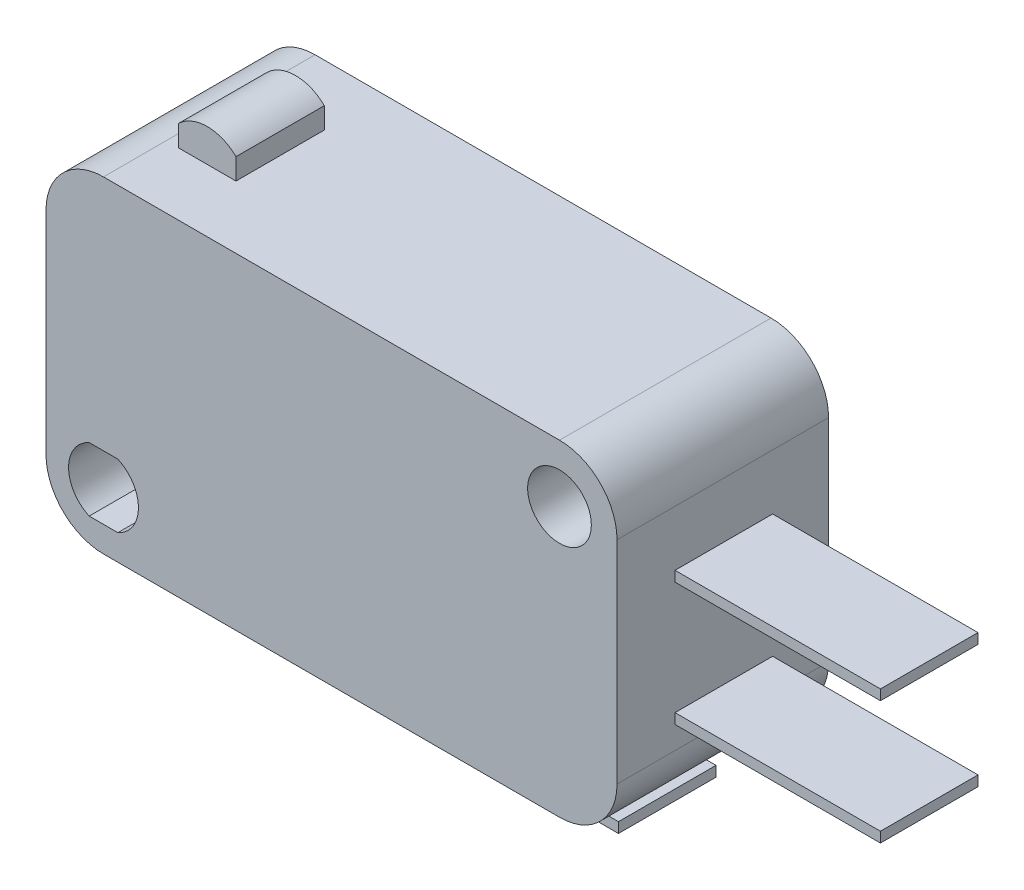
ISO-10303-21;
HEADER;
FILE_DESCRIPTION(('STEP AP214'),'2;1');
FILE_NAME('part.step','',(''),(''),'','','');
FILE_SCHEMA(('AUTOMOTIVE_DESIGN { 1 0 10303 214 1 1 1 1 }'));
ENDSEC;
DATA;
#1=APPLICATION_CONTEXT('core data for automotive mechanical design processes');
#2=APPLICATION_PROTOCOL_DEFINITION('international standard','automotive_design',2000,#1);
#3=PRODUCT_CONTEXT('',#1,'mechanical');
#4=PRODUCT('Part','Part','',(#3));
#5=PRODUCT_RELATED_PRODUCT_CATEGORY('part','',(#4));
#6=PRODUCT_DEFINITION_FORMATION('','',#4);
#7=PRODUCT_DEFINITION_CONTEXT('part definition',#1,'design');
#8=PRODUCT_DEFINITION('design','',#6,#7);
#9=PRODUCT_DEFINITION_SHAPE('','',#8);
#10=(LENGTH_UNIT() NAMED_UNIT(*) SI_UNIT(.MILLI.,.METRE.));
#11=(NAMED_UNIT(*) PLANE_ANGLE_UNIT() SI_UNIT($,.RADIAN.));
#12=(NAMED_UNIT(*) SI_UNIT($,.STERADIAN.) SOLID_ANGLE_UNIT());
#13=UNCERTAINTY_MEASURE_WITH_UNIT(LENGTH_MEASURE(1.E-05),#10,'distance_accuracy_value','');
#14=(GEOMETRIC_REPRESENTATION_CONTEXT(3) GLOBAL_UNCERTAINTY_ASSIGNED_CONTEXT((#13)) GLOBAL_UNIT_ASSIGNED_CONTEXT((#10,
#11,#12)) REPRESENTATION_CONTEXT('',''));
#15=CARTESIAN_POINT('',(0.,0.,0.));
#16=DIRECTION('',(0.,0.,1.));
#17=DIRECTION('',(1.,0.,0.));
#18=AXIS2_PLACEMENT_3D('',#15,#16,#17);
#19=CARTESIAN_POINT('',(-25.,2.8,5.15));
#20=DIRECTION('',(0.,-1.,0.));
#21=DIRECTION('',(0.,0.,-1.));
#22=AXIS2_PLACEMENT_3D('',#19,#20,#21);
#23=PLANE('',#22);
#24=DIRECTION('',(-1.,0.,0.));
#25=VECTOR('',#24,1.);
#26=CARTESIAN_POINT('',(-25.,2.8,-5.15));
#27=LINE('',#26,#25);
#28=CARTESIAN_POINT('',(0.,2.8,-5.15));
#29=VERTEX_POINT('',#28);
#30=CARTESIAN_POINT('',(-22.2,2.8,-5.15));
#31=VERTEX_POINT('',#30);
#32=EDGE_CURVE('E406',#29,#31,#27,.T.);
#33=ORIENTED_EDGE('',*,*,#32,.T.);
#34=DIRECTION('',(0.,0.,-1.));
#35=VECTOR('',#34,1.);
#36=CARTESIAN_POINT('',(-22.2,2.8,5.15));
#37=LINE('',#36,#35);
#38=CARTESIAN_POINT('',(-22.2,2.8,5.15));
#39=VERTEX_POINT('',#38);
#40=EDGE_CURVE('E436',#31,#39,#37,.F.);
#41=ORIENTED_EDGE('',*,*,#40,.T.);
#42=DIRECTION('',(-1.,0.,0.));
#43=VECTOR('',#42,1.);
#44=CARTESIAN_POINT('',(-25.,2.8,5.15));
#45=LINE('',#44,#43);
#46=CARTESIAN_POINT('',(0.,2.8,5.15));
#47=VERTEX_POINT('',#46);
#48=EDGE_CURVE('E417',#47,#39,#45,.T.);
#49=ORIENTED_EDGE('',*,*,#48,.F.);
#50=DIRECTION('',(0.,0.,-1.));
#51=VECTOR('',#50,1.);
#52=CARTESIAN_POINT('',(0.,2.8,5.15));
#53=LINE('',#52,#51);
#54=EDGE_CURVE('E433',#47,#29,#53,.T.);
#55=ORIENTED_EDGE('',*,*,#54,.T.);
#56=EDGE_LOOP('',(#33,#41,#49,#55));
#57=FACE_BOUND('',#56,.T.);
#58=DIRECTION('',(-1.,0.,0.));
#59=VECTOR('',#58,1.);
#60=CARTESIAN_POINT('',(-21.6,2.8,-2.2));
#61=LINE('',#60,#59);
#62=CARTESIAN_POINT('',(-18.8,2.8,-2.2));
#63=VERTEX_POINT('',#62);
#64=CARTESIAN_POINT('',(-21.6,2.8,-2.2));
#65=VERTEX_POINT('',#64);
#66=EDGE_CURVE('E244',#63,#65,#61,.T.);
#67=ORIENTED_EDGE('',*,*,#66,.F.);
#68=DIRECTION('',(0.,0.,1.));
#69=VECTOR('',#68,1.);
#70=CARTESIAN_POINT('',(-18.8,2.8,-2.2));
#71=LINE('',#70,#69);
#72=CARTESIAN_POINT('',(-18.8,2.8,2.1));
#73=VERTEX_POINT('',#72);
#74=EDGE_CURVE('E231',#63,#73,#71,.T.);
#75=ORIENTED_EDGE('',*,*,#74,.T.);
#76=DIRECTION('',(-1.,0.,0.));
#77=VECTOR('',#76,1.);
#78=CARTESIAN_POINT('',(-21.6,2.8,2.1));
#79=LINE('',#78,#77);
#80=CARTESIAN_POINT('',(-21.6,2.8,2.1));
#81=VERTEX_POINT('',#80);
#82=EDGE_CURVE('E218',#73,#81,#79,.T.);
#83=ORIENTED_EDGE('',*,*,#82,.T.);
#84=DIRECTION('',(0.,0.,1.));
#85=VECTOR('',#84,1.);
#86=CARTESIAN_POINT('',(-21.6,2.8,-2.2));
#87=LINE('',#86,#85);
#88=EDGE_CURVE('E249',#65,#81,#87,.T.);
#89=ORIENTED_EDGE('',*,*,#88,.F.);
#90=EDGE_LOOP('',(#67,#75,#83,#89));
#91=FACE_BOUND('',#90,.T.);
#92=ADVANCED_FACE('F16',(#57,#91),#23,.F.);
#93=CARTESIAN_POINT('',(-25.,-13.1,5.15));
#94=DIRECTION('',(0.,1.,0.));
#95=DIRECTION('',(-1.,0.,0.));
#96=AXIS2_PLACEMENT_3D('',#93,#94,#95);
#97=PLANE('',#96);
#98=DIRECTION('',(1.,0.,0.));
#99=VECTOR('',#98,1.);
#100=CARTESIAN_POINT('',(-25.,-13.1,5.15));
#101=LINE('',#100,#99);
#102=CARTESIAN_POINT('',(-22.2,-13.1,5.15));
#103=VERTEX_POINT('',#102);
#104=CARTESIAN_POINT('',(0.,-13.1,5.15));
#105=VERTEX_POINT('',#104);
#106=EDGE_CURVE('E412',#103,#105,#101,.T.);
#107=ORIENTED_EDGE('',*,*,#106,.F.);
#108=DIRECTION('',(0.,0.,-1.));
#109=VECTOR('',#108,1.);
#110=CARTESIAN_POINT('',(-22.2,-13.1,5.15));
#111=LINE('',#110,#109);
#112=CARTESIAN_POINT('',(-22.2,-13.1,-5.15));
#113=VERTEX_POINT('',#112);
#114=EDGE_CURVE('E448',#103,#113,#111,.T.);
#115=ORIENTED_EDGE('',*,*,#114,.T.);
#116=DIRECTION('',(1.,0.,0.));
#117=VECTOR('',#116,1.);
#118=CARTESIAN_POINT('',(-25.,-13.1,-5.15));
#119=LINE('',#118,#117);
#120=CARTESIAN_POINT('',(0.,-13.1,-5.15));
#121=VERTEX_POINT('',#120);
#122=EDGE_CURVE('E401',#113,#121,#119,.T.);
#123=ORIENTED_EDGE('',*,*,#122,.T.);
#124=DIRECTION('',(0.,0.,-1.));
#125=VECTOR('',#124,1.);
#126=CARTESIAN_POINT('',(0.,-13.1,5.15));
#127=LINE('',#126,#125);
#128=EDGE_CURVE('E446',#121,#105,#127,.F.);
#129=ORIENTED_EDGE('',*,*,#128,.T.);
#130=EDGE_LOOP('',(#107,#115,#123,#129));
#131=FACE_BOUND('',#130,.T.);
#132=DIRECTION('',(-1.,0.,0.));
#133=VECTOR('',#132,1.);
#134=CARTESIAN_POINT('',(-9.98,-13.1,1.5));
#135=LINE('',#134,#133);
#136=CARTESIAN_POINT('',(-9.48,-13.1,1.5));
#137=VERTEX_POINT('',#136);
#138=CARTESIAN_POINT('',(-9.98,-13.1,1.5));
#139=VERTEX_POINT('',#138);
#140=EDGE_CURVE('E302',#137,#139,#135,.T.);
#141=ORIENTED_EDGE('',*,*,#140,.F.);
#142=DIRECTION('',(0.,0.,-1.));
#143=VECTOR('',#142,1.);
#144=CARTESIAN_POINT('',(-9.48,-13.1,1.5));
#145=LINE('',#144,#143);
#146=CARTESIAN_POINT('',(-9.48,-13.1,-3.25));
#147=VERTEX_POINT('',#146);
#148=EDGE_CURVE('E315',#137,#147,#145,.T.);
#149=ORIENTED_EDGE('',*,*,#148,.T.);
#150=DIRECTION('',(-1.,0.,0.));
#151=VECTOR('',#150,1.);
#152=CARTESIAN_POINT('',(-9.98,-13.1,-3.25));
#153=LINE('',#152,#151);
#154=CARTESIAN_POINT('',(-9.98,-13.1,-3.25));
#155=VERTEX_POINT('',#154);
#156=EDGE_CURVE('E289',#147,#155,#153,.T.);
#157=ORIENTED_EDGE('',*,*,#156,.T.);
#158=DIRECTION('',(0.,0.,-1.));
#159=VECTOR('',#158,1.);
#160=CARTESIAN_POINT('',(-9.98,-13.1,1.5));
#161=LINE('',#160,#159);
#162=EDGE_CURVE('E330',#139,#155,#161,.T.);
#163=ORIENTED_EDGE('',*,*,#162,.F.);
#164=EDGE_LOOP('',(#141,#149,#157,#163));
#165=FACE_BOUND('',#164,.T.);
#166=ADVANCED_FACE('F454',(#131,#165),#97,.F.);
#167=CARTESIAN_POINT('',(2.8,2.8,5.15));
#168=DIRECTION('',(-1.,0.,0.));
#169=DIRECTION('',(0.,-1.,0.));
#170=AXIS2_PLACEMENT_3D('',#167,#168,#169);
#171=PLANE('',#170);
#172=DIRECTION('',(0.,-1.,0.));
#173=VECTOR('',#172,1.);
#174=CARTESIAN_POINT('',(2.8,-2.7,2.325));
#175=LINE('',#174,#173);
#176=CARTESIAN_POINT('',(2.8,-2.7,2.325));
#177=VERTEX_POINT('',#176);
#178=CARTESIAN_POINT('',(2.8,-3.2,2.325));
#179=VERTEX_POINT('',#178);
#180=EDGE_CURVE('E365',#177,#179,#175,.T.);
#181=ORIENTED_EDGE('',*,*,#180,.F.);
#182=DIRECTION('',(0.,0.,1.));
#183=VECTOR('',#182,1.);
#184=CARTESIAN_POINT('',(2.8,-2.7,2.325));
#185=LINE('',#184,#183);
#186=CARTESIAN_POINT('',(2.8,-2.7,-2.425));
#187=VERTEX_POINT('',#186);
#188=EDGE_CURVE('E374',#187,#177,#185,.T.);
#189=ORIENTED_EDGE('',*,*,#188,.F.);
#190=DIRECTION('',(0.,1.,0.));
#191=VECTOR('',#190,1.);
#192=CARTESIAN_POINT('',(2.8,-2.7,-2.425));
#193=LINE('',#192,#191);
#194=CARTESIAN_POINT('',(2.8,-3.2,-2.425));
#195=VERTEX_POINT('',#194);
#196=EDGE_CURVE('E371',#195,#187,#193,.T.);
#197=ORIENTED_EDGE('',*,*,#196,.F.);
#198=DIRECTION('',(0.,0.,-1.));
#199=VECTOR('',#198,1.);
#200=CARTESIAN_POINT('',(2.8,-3.2,2.325));
#201=LINE('',#200,#199);
#202=EDGE_CURVE('E368',#179,#195,#201,.T.);
#203=ORIENTED_EDGE('',*,*,#202,.F.);
#204=EDGE_LOOP('',(#181,#189,#197,#203));
#205=FACE_BOUND('',#204,.T.);
#206=DIRECTION('',(0.,1.,0.));
#207=VECTOR('',#206,1.);
#208=CARTESIAN_POINT('',(2.8,2.8,5.15));
#209=LINE('',#208,#207);
#210=CARTESIAN_POINT('',(2.8,-10.3,5.15));
#211=VERTEX_POINT('',#210);
#212=CARTESIAN_POINT('',(2.8,0.,5.15));
#213=VERTEX_POINT('',#212);
#214=EDGE_CURVE('E415',#211,#213,#209,.T.);
#215=ORIENTED_EDGE('',*,*,#214,.F.);
#216=DIRECTION('',(0.,0.,-1.));
#217=VECTOR('',#216,1.);
#218=CARTESIAN_POINT('',(2.8,-10.3,5.15));
#219=LINE('',#218,#217);
#220=CARTESIAN_POINT('',(2.8,-10.3,-5.15));
#221=VERTEX_POINT('',#220);
#222=EDGE_CURVE('E11',#211,#221,#219,.T.);
#223=ORIENTED_EDGE('',*,*,#222,.T.);
#224=DIRECTION('',(0.,1.,0.));
#225=VECTOR('',#224,1.);
#226=CARTESIAN_POINT('',(2.8,2.8,-5.15));
#227=LINE('',#226,#225);
#228=CARTESIAN_POINT('',(2.8,0.,-5.15));
#229=VERTEX_POINT('',#228);
#230=EDGE_CURVE('E404',#221,#229,#227,.T.);
#231=ORIENTED_EDGE('',*,*,#230,.T.);
#232=DIRECTION('',(0.,0.,-1.));
#233=VECTOR('',#232,1.);
#234=CARTESIAN_POINT('',(2.8,0.,5.15));
#235=LINE('',#234,#233);
#236=EDGE_CURVE('E24',#229,#213,#235,.F.);
#237=ORIENTED_EDGE('',*,*,#236,.T.);
#238=EDGE_LOOP('',(#215,#223,#231,#237));
#239=FACE_BOUND('',#238,.T.);
#240=DIRECTION('',(0.,-1.,0.));
#241=VECTOR('',#240,1.);
#242=CARTESIAN_POINT('',(2.8,-8.7,2.325));
#243=LINE('',#242,#241);
#244=CARTESIAN_POINT('',(2.8,-8.7,2.325));
#245=VERTEX_POINT('',#244);
#246=CARTESIAN_POINT('',(2.8,-9.2,2.325));
#247=VERTEX_POINT('',#246);
#248=EDGE_CURVE('E332',#245,#247,#243,.T.);
#249=ORIENTED_EDGE('',*,*,#248,.F.);
#250=DIRECTION('',(0.,0.,1.));
#251=VECTOR('',#250,1.);
#252=CARTESIAN_POINT('',(2.8,-8.7,2.325));
#253=LINE('',#252,#251);
#254=CARTESIAN_POINT('',(2.8,-8.7,-2.425));
#255=VERTEX_POINT('',#254);
#256=EDGE_CURVE('E341',#255,#245,#253,.T.);
#257=ORIENTED_EDGE('',*,*,#256,.F.);
#258=DIRECTION('',(0.,1.,0.));
#259=VECTOR('',#258,1.);
#260=CARTESIAN_POINT('',(2.8,-8.7,-2.425));
#261=LINE('',#260,#259);
#262=CARTESIAN_POINT('',(2.8,-9.2,-2.425));
#263=VERTEX_POINT('',#262);
#264=EDGE_CURVE('E338',#263,#255,#261,.T.);
#265=ORIENTED_EDGE('',*,*,#264,.F.);
#266=DIRECTION('',(0.,0.,-1.));
#267=VECTOR('',#266,1.);
#268=CARTESIAN_POINT('',(2.8,-9.2,2.325));
#269=LINE('',#268,#267);
#270=EDGE_CURVE('E335',#247,#263,#269,.T.);
#271=ORIENTED_EDGE('',*,*,#270,.F.);
#272=EDGE_LOOP('',(#249,#257,#265,#271));
#273=FACE_BOUND('',#272,.T.);
#274=ADVANCED_FACE('F467',(#205,#239,#273),#171,.F.);
#275=CARTESIAN_POINT('',(-25.,2.8,5.15));
#276=DIRECTION('',(1.,0.,0.));
#277=DIRECTION('',(0.,1.,0.));
#278=AXIS2_PLACEMENT_3D('',#275,#276,#277);
#279=PLANE('',#278);
#280=DIRECTION('',(0.,-1.,0.));
#281=VECTOR('',#280,1.);
#282=CARTESIAN_POINT('',(-25.,2.8,5.15));
#283=LINE('',#282,#281);
#284=CARTESIAN_POINT('',(-25.,0.,5.15));
#285=VERTEX_POINT('',#284);
#286=CARTESIAN_POINT('',(-25.,-10.3,5.15));
#287=VERTEX_POINT('',#286);
#288=EDGE_CURVE('E409',#285,#287,#283,.T.);
#289=ORIENTED_EDGE('',*,*,#288,.F.);
#290=DIRECTION('',(0.,0.,-1.));
#291=VECTOR('',#290,1.);
#292=CARTESIAN_POINT('',(-25.,0.,5.15));
#293=LINE('',#292,#291);
#294=CARTESIAN_POINT('',(-25.,0.,-5.15));
#295=VERTEX_POINT('',#294);
#296=EDGE_CURVE('E422',#285,#295,#293,.T.);
#297=ORIENTED_EDGE('',*,*,#296,.T.);
#298=DIRECTION('',(0.,-1.,0.));
#299=VECTOR('',#298,1.);
#300=CARTESIAN_POINT('',(-25.,2.8,-5.15));
#301=LINE('',#300,#299);
#302=CARTESIAN_POINT('',(-25.,-10.3,-5.15));
#303=VERTEX_POINT('',#302);
#304=EDGE_CURVE('E398',#295,#303,#301,.T.);
#305=ORIENTED_EDGE('',*,*,#304,.T.);
#306=DIRECTION('',(0.,0.,-1.));
#307=VECTOR('',#306,1.);
#308=CARTESIAN_POINT('',(-25.,-10.3,5.15));
#309=LINE('',#308,#307);
#310=EDGE_CURVE('E420',#303,#287,#309,.F.);
#311=ORIENTED_EDGE('',*,*,#310,.T.);
#312=EDGE_LOOP('',(#289,#297,#305,#311));
#313=FACE_BOUND('',#312,.T.);
#314=ADVANCED_FACE('F18',(#313),#279,.F.);
#315=CARTESIAN_POINT('',(-25.,2.8,5.15));
#316=DIRECTION('',(0.,0.,1.));
#317=DIRECTION('',(1.,0.,0.));
#318=AXIS2_PLACEMENT_3D('',#315,#316,#317);
#319=PLANE('',#318);
#320=CARTESIAN_POINT('',(-22.2,-10.3,5.15));
#321=DIRECTION('',(0.,0.,1.));
#322=DIRECTION('',(1.,0.,0.));
#323=AXIS2_PLACEMENT_3D('',#320,#321,#322);
#324=CIRCLE('',#323,1.7);
#325=CARTESIAN_POINT('',(-22.8982120021885,-8.75,5.15));
#326=VERTEX_POINT('',#325);
#327=CARTESIAN_POINT('',(-22.8982120021884,-11.85,5.15));
#328=VERTEX_POINT('',#327);
#329=EDGE_CURVE('E230',#326,#328,#324,.T.);
#330=ORIENTED_EDGE('',*,*,#329,.F.);
#331=DIRECTION('',(-1.,0.,0.));
#332=VECTOR('',#331,1.);
#333=CARTESIAN_POINT('',(-22.8982120021885,-8.75,5.15));
#334=LINE('',#333,#332);
#335=CARTESIAN_POINT('',(-21.5017879978115,-8.75,5.15));
#336=VERTEX_POINT('',#335);
#337=EDGE_CURVE('E259',#336,#326,#334,.T.);
#338=ORIENTED_EDGE('',*,*,#337,.F.);
#339=CARTESIAN_POINT('',(-22.2,-10.3,5.15));
#340=DIRECTION('',(0.,0.,1.));
#341=DIRECTION('',(1.,0.,0.));
#342=AXIS2_PLACEMENT_3D('',#339,#340,#341);
#343=CIRCLE('',#342,1.7);
#344=CARTESIAN_POINT('',(-21.5017879978116,-11.85,5.15));
#345=VERTEX_POINT('',#344);
#346=EDGE_CURVE('E256',#345,#336,#343,.T.);
#347=ORIENTED_EDGE('',*,*,#346,.F.);
#348=DIRECTION('',(1.,0.,0.));
#349=VECTOR('',#348,1.);
#350=CARTESIAN_POINT('',(-22.8982120021884,-11.85,5.15));
#351=LINE('',#350,#349);
#352=EDGE_CURVE('E253',#328,#345,#351,.T.);
#353=ORIENTED_EDGE('',*,*,#352,.F.);
#354=EDGE_LOOP('',(#330,#338,#347,#353));
#355=FACE_BOUND('',#354,.T.);
#356=CARTESIAN_POINT('',(0.,0.,5.15));
#357=DIRECTION('',(0.,0.,1.));
#358=DIRECTION('',(1.,0.,0.));
#359=AXIS2_PLACEMENT_3D('',#356,#357,#358);
#360=CIRCLE('',#359,1.55);
#361=CARTESIAN_POINT('',(1.55,0.,5.15));
#362=VERTEX_POINT('',#361);
#363=EDGE_CURVE('E277',#362,#362,#360,.T.);
#364=ORIENTED_EDGE('',*,*,#363,.F.);
#365=EDGE_LOOP('',(#364));
#366=FACE_BOUND('',#365,.T.);
#367=ORIENTED_EDGE('',*,*,#48,.T.);
#368=CARTESIAN_POINT('',(-22.2,0.,5.15));
#369=DIRECTION('',(0.,0.,1.));
#370=DIRECTION('',(1.,0.,0.));
#371=AXIS2_PLACEMENT_3D('',#368,#369,#370);
#372=CIRCLE('',#371,2.8);
#373=EDGE_CURVE('E444',#39,#285,#372,.T.);
#374=ORIENTED_EDGE('',*,*,#373,.T.);
#375=ORIENTED_EDGE('',*,*,#288,.T.);
#376=CARTESIAN_POINT('',(-22.2,-10.3,5.15));
#377=DIRECTION('',(0.,0.,1.));
#378=DIRECTION('',(1.,0.,0.));
#379=AXIS2_PLACEMENT_3D('',#376,#377,#378);
#380=CIRCLE('',#379,2.8);
#381=EDGE_CURVE('E442',#287,#103,#380,.T.);
#382=ORIENTED_EDGE('',*,*,#381,.T.);
#383=ORIENTED_EDGE('',*,*,#106,.T.);
#384=CARTESIAN_POINT('',(0.,-10.3,5.15));
#385=DIRECTION('',(0.,0.,1.));
#386=DIRECTION('',(1.,0.,0.));
#387=AXIS2_PLACEMENT_3D('',#384,#385,#386);
#388=CIRCLE('',#387,2.8);
#389=EDGE_CURVE('E440',#105,#211,#388,.T.);
#390=ORIENTED_EDGE('',*,*,#389,.T.);
#391=ORIENTED_EDGE('',*,*,#214,.T.);
#392=CARTESIAN_POINT('',(0.,0.,5.15));
#393=DIRECTION('',(0.,0.,1.));
#394=DIRECTION('',(1.,0.,0.));
#395=AXIS2_PLACEMENT_3D('',#392,#393,#394);
#396=CIRCLE('',#395,2.8);
#397=EDGE_CURVE('E438',#213,#47,#396,.T.);
#398=ORIENTED_EDGE('',*,*,#397,.T.);
#399=EDGE_LOOP('',(#367,#374,#375,#382,#383,#390,#391,#398));
#400=FACE_BOUND('',#399,.T.);
#401=ADVANCED_FACE('F471',(#355,#366,#400),#319,.T.);
#402=CARTESIAN_POINT('',(-25.,2.8,-5.15));
#403=DIRECTION('',(0.,0.,1.));
#404=DIRECTION('',(1.,0.,0.));
#405=AXIS2_PLACEMENT_3D('',#402,#403,#404);
#406=PLANE('',#405);
#407=DIRECTION('',(-1.,0.,0.));
#408=VECTOR('',#407,1.);
#409=CARTESIAN_POINT('',(-22.8982120021885,-8.75,-5.15));
#410=LINE('',#409,#408);
#411=CARTESIAN_POINT('',(-21.5017879978115,-8.75,-5.15));
#412=VERTEX_POINT('',#411);
#413=CARTESIAN_POINT('',(-22.8982120021885,-8.75,-5.15));
#414=VERTEX_POINT('',#413);
#415=EDGE_CURVE('E271',#412,#414,#410,.T.);
#416=ORIENTED_EDGE('',*,*,#415,.T.);
#417=CARTESIAN_POINT('',(-22.2,-10.3,-5.15));
#418=DIRECTION('',(0.,0.,1.));
#419=DIRECTION('',(1.,0.,0.));
#420=AXIS2_PLACEMENT_3D('',#417,#418,#419);
#421=CIRCLE('',#420,1.7);
#422=CARTESIAN_POINT('',(-22.8982120021884,-11.85,-5.15));
#423=VERTEX_POINT('',#422);
#424=EDGE_CURVE('E262',#414,#423,#421,.T.);
#425=ORIENTED_EDGE('',*,*,#424,.T.);
#426=DIRECTION('',(1.,0.,0.));
#427=VECTOR('',#426,1.);
#428=CARTESIAN_POINT('',(-22.8982120021884,-11.85,-5.15));
#429=LINE('',#428,#427);
#430=CARTESIAN_POINT('',(-21.5017879978116,-11.85,-5.15));
#431=VERTEX_POINT('',#430);
#432=EDGE_CURVE('E265',#423,#431,#429,.T.);
#433=ORIENTED_EDGE('',*,*,#432,.T.);
#434=CARTESIAN_POINT('',(-22.2,-10.3,-5.15));
#435=DIRECTION('',(0.,0.,1.));
#436=DIRECTION('',(1.,0.,0.));
#437=AXIS2_PLACEMENT_3D('',#434,#435,#436);
#438=CIRCLE('',#437,1.7);
#439=EDGE_CURVE('E268',#431,#412,#438,.T.);
#440=ORIENTED_EDGE('',*,*,#439,.T.);
#441=EDGE_LOOP('',(#416,#425,#433,#440));
#442=FACE_BOUND('',#441,.T.);
#443=CARTESIAN_POINT('',(0.,0.,-5.15));
#444=DIRECTION('',(0.,0.,1.));
#445=DIRECTION('',(1.,0.,0.));
#446=AXIS2_PLACEMENT_3D('',#443,#444,#445);
#447=CIRCLE('',#446,1.55);
#448=CARTESIAN_POINT('',(1.55,0.,-5.15));
#449=VERTEX_POINT('',#448);
#450=EDGE_CURVE('E286',#449,#449,#447,.T.);
#451=ORIENTED_EDGE('',*,*,#450,.T.);
#452=EDGE_LOOP('',(#451));
#453=FACE_BOUND('',#452,.T.);
#454=ORIENTED_EDGE('',*,*,#304,.F.);
#455=CARTESIAN_POINT('',(-22.2,0.,-5.15));
#456=DIRECTION('',(0.,0.,1.));
#457=DIRECTION('',(1.,0.,0.));
#458=AXIS2_PLACEMENT_3D('',#455,#456,#457);
#459=CIRCLE('',#458,2.8);
#460=EDGE_CURVE('E431',#295,#31,#459,.F.);
#461=ORIENTED_EDGE('',*,*,#460,.T.);
#462=ORIENTED_EDGE('',*,*,#32,.F.);
#463=CARTESIAN_POINT('',(0.,0.,-5.15));
#464=DIRECTION('',(0.,0.,1.));
#465=DIRECTION('',(1.,0.,0.));
#466=AXIS2_PLACEMENT_3D('',#463,#464,#465);
#467=CIRCLE('',#466,2.8);
#468=EDGE_CURVE('E425',#29,#229,#467,.F.);
#469=ORIENTED_EDGE('',*,*,#468,.T.);
#470=ORIENTED_EDGE('',*,*,#230,.F.);
#471=CARTESIAN_POINT('',(0.,-10.3,-5.15));
#472=DIRECTION('',(0.,0.,1.));
#473=DIRECTION('',(1.,0.,0.));
#474=AXIS2_PLACEMENT_3D('',#471,#472,#473);
#475=CIRCLE('',#474,2.8);
#476=EDGE_CURVE('E427',#221,#121,#475,.F.);
#477=ORIENTED_EDGE('',*,*,#476,.T.);
#478=ORIENTED_EDGE('',*,*,#122,.F.);
#479=CARTESIAN_POINT('',(-22.2,-10.3,-5.15));
#480=DIRECTION('',(0.,0.,1.));
#481=DIRECTION('',(1.,0.,0.));
#482=AXIS2_PLACEMENT_3D('',#479,#480,#481);
#483=CIRCLE('',#482,2.8);
#484=EDGE_CURVE('E429',#113,#303,#483,.F.);
#485=ORIENTED_EDGE('',*,*,#484,.T.);
#486=EDGE_LOOP('',(#454,#461,#462,#469,#470,#477,#478,#485));
#487=FACE_BOUND('',#486,.T.);
#488=ADVANCED_FACE('F461',(#442,#453,#487),#406,.F.);
#489=CARTESIAN_POINT('',(12.8,-2.7,2.325));
#490=DIRECTION('',(0.,0.,-1.));
#491=DIRECTION('',(0.,1.,0.));
#492=AXIS2_PLACEMENT_3D('',#489,#490,#491);
#493=PLANE('',#492);
#494=ORIENTED_EDGE('',*,*,#180,.T.);
#495=DIRECTION('',(-1.,0.,0.));
#496=VECTOR('',#495,1.);
#497=CARTESIAN_POINT('',(12.8,-3.2,2.325));
#498=LINE('',#497,#496);
#499=CARTESIAN_POINT('',(12.8,-3.2,2.325));
#500=VERTEX_POINT('',#499);
#501=EDGE_CURVE('E395',#500,#179,#498,.T.);
#502=ORIENTED_EDGE('',*,*,#501,.F.);
#503=DIRECTION('',(0.,-1.,0.));
#504=VECTOR('',#503,1.);
#505=CARTESIAN_POINT('',(12.8,-2.7,2.325));
#506=LINE('',#505,#504);
#507=CARTESIAN_POINT('',(12.8,-2.7,2.325));
#508=VERTEX_POINT('',#507);
#509=EDGE_CURVE('E377',#508,#500,#506,.T.);
#510=ORIENTED_EDGE('',*,*,#509,.F.);
#511=DIRECTION('',(-1.,0.,0.));
#512=VECTOR('',#511,1.);
#513=CARTESIAN_POINT('',(12.8,-2.7,2.325));
#514=LINE('',#513,#512);
#515=EDGE_CURVE('E386',#508,#177,#514,.T.);
#516=ORIENTED_EDGE('',*,*,#515,.T.);
#517=EDGE_LOOP('',(#494,#502,#510,#516));
#518=FACE_BOUND('',#517,.T.);
#519=ADVANCED_FACE('F519',(#518),#493,.F.);
#520=CARTESIAN_POINT('',(12.8,-3.2,2.325));
#521=DIRECTION('',(0.,1.,0.));
#522=DIRECTION('',(-1.,0.,0.));
#523=AXIS2_PLACEMENT_3D('',#520,#521,#522);
#524=PLANE('',#523);
#525=ORIENTED_EDGE('',*,*,#202,.T.);
#526=DIRECTION('',(-1.,0.,0.));
#527=VECTOR('',#526,1.);
#528=CARTESIAN_POINT('',(12.8,-3.2,-2.425));
#529=LINE('',#528,#527);
#530=CARTESIAN_POINT('',(12.8,-3.2,-2.425));
#531=VERTEX_POINT('',#530);
#532=EDGE_CURVE('E392',#531,#195,#529,.T.);
#533=ORIENTED_EDGE('',*,*,#532,.F.);
#534=DIRECTION('',(0.,0.,-1.));
#535=VECTOR('',#534,1.);
#536=CARTESIAN_POINT('',(12.8,-3.2,2.325));
#537=LINE('',#536,#535);
#538=EDGE_CURVE('E380',#500,#531,#537,.T.);
#539=ORIENTED_EDGE('',*,*,#538,.F.);
#540=ORIENTED_EDGE('',*,*,#501,.T.);
#541=EDGE_LOOP('',(#525,#533,#539,#540));
#542=FACE_BOUND('',#541,.T.);
#543=ADVANCED_FACE('F527',(#542),#524,.F.);
#544=CARTESIAN_POINT('',(12.8,-2.7,-2.425));
#545=DIRECTION('',(0.,0.,1.));
#546=DIRECTION('',(0.,-1.,0.));
#547=AXIS2_PLACEMENT_3D('',#544,#545,#546);
#548=PLANE('',#547);
#549=ORIENTED_EDGE('',*,*,#196,.T.);
#550=DIRECTION('',(-1.,0.,0.));
#551=VECTOR('',#550,1.);
#552=CARTESIAN_POINT('',(12.8,-2.7,-2.425));
#553=LINE('',#552,#551);
#554=CARTESIAN_POINT('',(12.8,-2.7,-2.425));
#555=VERTEX_POINT('',#554);
#556=EDGE_CURVE('E389',#555,#187,#553,.T.);
#557=ORIENTED_EDGE('',*,*,#556,.F.);
#558=DIRECTION('',(0.,1.,0.));
#559=VECTOR('',#558,1.);
#560=CARTESIAN_POINT('',(12.8,-2.7,-2.425));
#561=LINE('',#560,#559);
#562=EDGE_CURVE('E382',#531,#555,#561,.T.);
#563=ORIENTED_EDGE('',*,*,#562,.F.);
#564=ORIENTED_EDGE('',*,*,#532,.T.);
#565=EDGE_LOOP('',(#549,#557,#563,#564));
#566=FACE_BOUND('',#565,.T.);
#567=ADVANCED_FACE('F525',(#566),#548,.F.);
#568=CARTESIAN_POINT('',(12.8,-2.7,2.325));
#569=DIRECTION('',(0.,-1.,0.));
#570=DIRECTION('',(1.,0.,0.));
#571=AXIS2_PLACEMENT_3D('',#568,#569,#570);
#572=PLANE('',#571);
#573=ORIENTED_EDGE('',*,*,#188,.T.);
#574=ORIENTED_EDGE('',*,*,#515,.F.);
#575=DIRECTION('',(0.,0.,1.));
#576=VECTOR('',#575,1.);
#577=CARTESIAN_POINT('',(12.8,-2.7,2.325));
#578=LINE('',#577,#576);
#579=EDGE_CURVE('E384',#555,#508,#578,.T.);
#580=ORIENTED_EDGE('',*,*,#579,.F.);
#581=ORIENTED_EDGE('',*,*,#556,.T.);
#582=EDGE_LOOP('',(#573,#574,#580,#581));
#583=FACE_BOUND('',#582,.T.);
#584=ADVANCED_FACE('F515',(#583),#572,.F.);
#585=CARTESIAN_POINT('',(12.8,-3.2,2.325));
#586=DIRECTION('',(1.,0.,0.));
#587=DIRECTION('',(0.,0.,-1.));
#588=AXIS2_PLACEMENT_3D('',#585,#586,#587);
#589=PLANE('',#588);
#590=ORIENTED_EDGE('',*,*,#509,.T.);
#591=ORIENTED_EDGE('',*,*,#538,.T.);
#592=ORIENTED_EDGE('',*,*,#562,.T.);
#593=ORIENTED_EDGE('',*,*,#579,.T.);
#594=EDGE_LOOP('',(#590,#591,#592,#593));
#595=FACE_BOUND('',#594,.T.);
#596=ADVANCED_FACE('F521',(#595),#589,.T.);
#597=CARTESIAN_POINT('',(12.8,-8.7,2.325));
#598=DIRECTION('',(0.,0.,-1.));
#599=DIRECTION('',(0.,1.,0.));
#600=AXIS2_PLACEMENT_3D('',#597,#598,#599);
#601=PLANE('',#600);
#602=ORIENTED_EDGE('',*,*,#248,.T.);
#603=DIRECTION('',(-1.,0.,0.));
#604=VECTOR('',#603,1.);
#605=CARTESIAN_POINT('',(12.8,-9.2,2.325));
#606=LINE('',#605,#604);
#607=CARTESIAN_POINT('',(12.8,-9.2,2.325));
#608=VERTEX_POINT('',#607);
#609=EDGE_CURVE('E362',#608,#247,#606,.T.);
#610=ORIENTED_EDGE('',*,*,#609,.F.);
#611=DIRECTION('',(0.,-1.,0.));
#612=VECTOR('',#611,1.);
#613=CARTESIAN_POINT('',(12.8,-8.7,2.325));
#614=LINE('',#613,#612);
#615=CARTESIAN_POINT('',(12.8,-8.7,2.325));
#616=VERTEX_POINT('',#615);
#617=EDGE_CURVE('E344',#616,#608,#614,.T.);
#618=ORIENTED_EDGE('',*,*,#617,.F.);
#619=DIRECTION('',(-1.,0.,0.));
#620=VECTOR('',#619,1.);
#621=CARTESIAN_POINT('',(12.8,-8.7,2.325));
#622=LINE('',#621,#620);
#623=EDGE_CURVE('E353',#616,#245,#622,.T.);
#624=ORIENTED_EDGE('',*,*,#623,.T.);
#625=EDGE_LOOP('',(#602,#610,#618,#624));
#626=FACE_BOUND('',#625,.T.);
#627=ADVANCED_FACE('F605',(#626),#601,.F.);
#628=CARTESIAN_POINT('',(12.8,-9.2,2.325));
#629=DIRECTION('',(0.,1.,0.));
#630=DIRECTION('',(-1.,0.,0.));
#631=AXIS2_PLACEMENT_3D('',#628,#629,#630);
#632=PLANE('',#631);
#633=ORIENTED_EDGE('',*,*,#270,.T.);
#634=DIRECTION('',(-1.,0.,0.));
#635=VECTOR('',#634,1.);
#636=CARTESIAN_POINT('',(12.8,-9.2,-2.425));
#637=LINE('',#636,#635);
#638=CARTESIAN_POINT('',(12.8,-9.2,-2.425));
#639=VERTEX_POINT('',#638);
#640=EDGE_CURVE('E359',#639,#263,#637,.T.);
#641=ORIENTED_EDGE('',*,*,#640,.F.);
#642=DIRECTION('',(0.,0.,-1.));
#643=VECTOR('',#642,1.);
#644=CARTESIAN_POINT('',(12.8,-9.2,2.325));
#645=LINE('',#644,#643);
#646=EDGE_CURVE('E347',#608,#639,#645,.T.);
#647=ORIENTED_EDGE('',*,*,#646,.F.);
#648=ORIENTED_EDGE('',*,*,#609,.T.);
#649=EDGE_LOOP('',(#633,#641,#647,#648));
#650=FACE_BOUND('',#649,.T.);
#651=ADVANCED_FACE('F601',(#650),#632,.F.);
#652=CARTESIAN_POINT('',(12.8,-8.7,-2.425));
#653=DIRECTION('',(0.,0.,1.));
#654=DIRECTION('',(1.,0.,0.));
#655=AXIS2_PLACEMENT_3D('',#652,#653,#654);
#656=PLANE('',#655);
#657=ORIENTED_EDGE('',*,*,#264,.T.);
#658=DIRECTION('',(-1.,0.,0.));
#659=VECTOR('',#658,1.);
#660=CARTESIAN_POINT('',(12.8,-8.7,-2.425));
#661=LINE('',#660,#659);
#662=CARTESIAN_POINT('',(12.8,-8.7,-2.425));
#663=VERTEX_POINT('',#662);
#664=EDGE_CURVE('E356',#663,#255,#661,.T.);
#665=ORIENTED_EDGE('',*,*,#664,.F.);
#666=DIRECTION('',(0.,1.,0.));
#667=VECTOR('',#666,1.);
#668=CARTESIAN_POINT('',(12.8,-8.7,-2.425));
#669=LINE('',#668,#667);
#670=EDGE_CURVE('E349',#639,#663,#669,.T.);
#671=ORIENTED_EDGE('',*,*,#670,.F.);
#672=ORIENTED_EDGE('',*,*,#640,.T.);
#673=EDGE_LOOP('',(#657,#665,#671,#672));
#674=FACE_BOUND('',#673,.T.);
#675=ADVANCED_FACE('F597',(#674),#656,.F.);
#676=CARTESIAN_POINT('',(12.8,-8.7,2.325));
#677=DIRECTION('',(0.,-1.,0.));
#678=DIRECTION('',(1.,0.,0.));
#679=AXIS2_PLACEMENT_3D('',#676,#677,#678);
#680=PLANE('',#679);
#681=ORIENTED_EDGE('',*,*,#256,.T.);
#682=ORIENTED_EDGE('',*,*,#623,.F.);
#683=DIRECTION('',(0.,0.,1.));
#684=VECTOR('',#683,1.);
#685=CARTESIAN_POINT('',(12.8,-8.7,2.325));
#686=LINE('',#685,#684);
#687=EDGE_CURVE('E351',#663,#616,#686,.T.);
#688=ORIENTED_EDGE('',*,*,#687,.F.);
#689=ORIENTED_EDGE('',*,*,#664,.T.);
#690=EDGE_LOOP('',(#681,#682,#688,#689));
#691=FACE_BOUND('',#690,.T.);
#692=ADVANCED_FACE('F593',(#691),#680,.F.);
#693=CARTESIAN_POINT('',(12.8,-9.2,2.325));
#694=DIRECTION('',(1.,0.,0.));
#695=DIRECTION('',(0.,0.,-1.));
#696=AXIS2_PLACEMENT_3D('',#693,#694,#695);
#697=PLANE('',#696);
#698=ORIENTED_EDGE('',*,*,#617,.T.);
#699=ORIENTED_EDGE('',*,*,#646,.T.);
#700=ORIENTED_EDGE('',*,*,#670,.T.);
#701=ORIENTED_EDGE('',*,*,#687,.T.);
#702=EDGE_LOOP('',(#698,#699,#700,#701));
#703=FACE_BOUND('',#702,.T.);
#704=ADVANCED_FACE('F589',(#703),#697,.T.);
#705=CARTESIAN_POINT('',(-9.98,-16.,1.5));
#706=DIRECTION('',(1.,0.,0.));
#707=DIRECTION('',(0.,0.,-1.));
#708=AXIS2_PLACEMENT_3D('',#705,#706,#707);
#709=PLANE('',#708);
#710=DIRECTION('',(0.,-1.,0.));
#711=VECTOR('',#710,1.);
#712=CARTESIAN_POINT('',(-9.98,-16.,-3.25));
#713=LINE('',#712,#711);
#714=CARTESIAN_POINT('',(-9.98,-16.,-3.25));
#715=VERTEX_POINT('',#714);
#716=EDGE_CURVE('E292',#155,#715,#713,.T.);
#717=ORIENTED_EDGE('',*,*,#716,.T.);
#718=DIRECTION('',(0.,0.,-1.));
#719=VECTOR('',#718,1.);
#720=CARTESIAN_POINT('',(-9.98,-16.,1.5));
#721=LINE('',#720,#719);
#722=CARTESIAN_POINT('',(-9.98,-16.,1.5));
#723=VERTEX_POINT('',#722);
#724=EDGE_CURVE('E327',#723,#715,#721,.T.);
#725=ORIENTED_EDGE('',*,*,#724,.F.);
#726=DIRECTION('',(0.,-1.,0.));
#727=VECTOR('',#726,1.);
#728=CARTESIAN_POINT('',(-9.98,-16.,1.5));
#729=LINE('',#728,#727);
#730=EDGE_CURVE('E305',#139,#723,#729,.T.);
#731=ORIENTED_EDGE('',*,*,#730,.F.);
#732=ORIENTED_EDGE('',*,*,#162,.T.);
#733=EDGE_LOOP('',(#717,#725,#731,#732));
#734=FACE_BOUND('',#733,.T.);
#735=ADVANCED_FACE('F585',(#734),#709,.F.);
#736=CARTESIAN_POINT('',(-0.78,-16.,1.5));
#737=DIRECTION('',(0.,1.,0.));
#738=DIRECTION('',(0.,0.,1.));
#739=AXIS2_PLACEMENT_3D('',#736,#737,#738);
#740=PLANE('',#739);
#741=DIRECTION('',(1.,0.,0.));
#742=VECTOR('',#741,1.);
#743=CARTESIAN_POINT('',(-0.78,-16.,-3.25));
#744=LINE('',#743,#742);
#745=CARTESIAN_POINT('',(-0.78,-16.,-3.25));
#746=VERTEX_POINT('',#745);
#747=EDGE_CURVE('E294',#715,#746,#744,.T.);
#748=ORIENTED_EDGE('',*,*,#747,.T.);
#749=DIRECTION('',(0.,0.,-1.));
#750=VECTOR('',#749,1.);
#751=CARTESIAN_POINT('',(-0.78,-16.,1.5));
#752=LINE('',#751,#750);
#753=CARTESIAN_POINT('',(-0.78,-16.,1.5));
#754=VERTEX_POINT('',#753);
#755=EDGE_CURVE('E324',#754,#746,#752,.T.);
#756=ORIENTED_EDGE('',*,*,#755,.F.);
#757=DIRECTION('',(1.,0.,0.));
#758=VECTOR('',#757,1.);
#759=CARTESIAN_POINT('',(-0.78,-16.,1.5));
#760=LINE('',#759,#758);
#761=EDGE_CURVE('E307',#723,#754,#760,.T.);
#762=ORIENTED_EDGE('',*,*,#761,.F.);
#763=ORIENTED_EDGE('',*,*,#724,.T.);
#764=EDGE_LOOP('',(#748,#756,#762,#763));
#765=FACE_BOUND('',#764,.T.);
#766=ADVANCED_FACE('F581',(#765),#740,.F.);
#767=CARTESIAN_POINT('',(-0.78,-15.5,1.5));
#768=DIRECTION('',(-1.,0.,0.));
#769=DIRECTION('',(0.,0.,1.));
#770=AXIS2_PLACEMENT_3D('',#767,#768,#769);
#771=PLANE('',#770);
#772=DIRECTION('',(0.,1.,0.));
#773=VECTOR('',#772,1.);
#774=CARTESIAN_POINT('',(-0.78,-15.5,-3.25));
#775=LINE('',#774,#773);
#776=CARTESIAN_POINT('',(-0.78,-15.5,-3.25));
#777=VERTEX_POINT('',#776);
#778=EDGE_CURVE('E296',#746,#777,#775,.T.);
#779=ORIENTED_EDGE('',*,*,#778,.T.);
#780=DIRECTION('',(0.,0.,-1.));
#781=VECTOR('',#780,1.);
#782=CARTESIAN_POINT('',(-0.78,-15.5,1.5));
#783=LINE('',#782,#781);
#784=CARTESIAN_POINT('',(-0.78,-15.5,1.5));
#785=VERTEX_POINT('',#784);
#786=EDGE_CURVE('E321',#785,#777,#783,.T.);
#787=ORIENTED_EDGE('',*,*,#786,.F.);
#788=DIRECTION('',(0.,1.,0.));
#789=VECTOR('',#788,1.);
#790=CARTESIAN_POINT('',(-0.78,-15.5,1.5));
#791=LINE('',#790,#789);
#792=EDGE_CURVE('E309',#754,#785,#791,.T.);
#793=ORIENTED_EDGE('',*,*,#792,.F.);
#794=ORIENTED_EDGE('',*,*,#755,.T.);
#795=EDGE_LOOP('',(#779,#787,#793,#794));
#796=FACE_BOUND('',#795,.T.);
#797=ADVANCED_FACE('F577',(#796),#771,.F.);
#798=CARTESIAN_POINT('',(-9.48,-15.5,1.5));
#799=DIRECTION('',(0.,-1.,0.));
#800=DIRECTION('',(0.,0.,-1.));
#801=AXIS2_PLACEMENT_3D('',#798,#799,#800);
#802=PLANE('',#801);
#803=DIRECTION('',(-1.,0.,0.));
#804=VECTOR('',#803,1.);
#805=CARTESIAN_POINT('',(-9.48,-15.5,-3.25));
#806=LINE('',#805,#804);
#807=CARTESIAN_POINT('',(-9.48,-15.5,-3.25));
#808=VERTEX_POINT('',#807);
#809=EDGE_CURVE('E298',#777,#808,#806,.T.);
#810=ORIENTED_EDGE('',*,*,#809,.T.);
#811=DIRECTION('',(0.,0.,-1.));
#812=VECTOR('',#811,1.);
#813=CARTESIAN_POINT('',(-9.48,-15.5,1.5));
#814=LINE('',#813,#812);
#815=CARTESIAN_POINT('',(-9.48,-15.5,1.5));
#816=VERTEX_POINT('',#815);
#817=EDGE_CURVE('E318',#816,#808,#814,.T.);
#818=ORIENTED_EDGE('',*,*,#817,.F.);
#819=DIRECTION('',(-1.,0.,0.));
#820=VECTOR('',#819,1.);
#821=CARTESIAN_POINT('',(-9.48,-15.5,1.5));
#822=LINE('',#821,#820);
#823=EDGE_CURVE('E311',#785,#816,#822,.T.);
#824=ORIENTED_EDGE('',*,*,#823,.F.);
#825=ORIENTED_EDGE('',*,*,#786,.T.);
#826=EDGE_LOOP('',(#810,#818,#824,#825));
#827=FACE_BOUND('',#826,.T.);
#828=ADVANCED_FACE('F573',(#827),#802,.F.);
#829=CARTESIAN_POINT('',(-9.48,-13.1,1.5));
#830=DIRECTION('',(-1.,0.,0.));
#831=DIRECTION('',(0.,0.,1.));
#832=AXIS2_PLACEMENT_3D('',#829,#830,#831);
#833=PLANE('',#832);
#834=DIRECTION('',(0.,1.,0.));
#835=VECTOR('',#834,1.);
#836=CARTESIAN_POINT('',(-9.48,-13.1,-3.25));
#837=LINE('',#836,#835);
#838=EDGE_CURVE('E300',#808,#147,#837,.T.);
#839=ORIENTED_EDGE('',*,*,#838,.T.);
#840=ORIENTED_EDGE('',*,*,#148,.F.);
#841=DIRECTION('',(0.,1.,0.));
#842=VECTOR('',#841,1.);
#843=CARTESIAN_POINT('',(-9.48,-13.1,1.5));
#844=LINE('',#843,#842);
#845=EDGE_CURVE('E313',#816,#137,#844,.T.);
#846=ORIENTED_EDGE('',*,*,#845,.F.);
#847=ORIENTED_EDGE('',*,*,#817,.T.);
#848=EDGE_LOOP('',(#839,#840,#846,#847));
#849=FACE_BOUND('',#848,.T.);
#850=ADVANCED_FACE('F569',(#849),#833,.F.);
#851=CARTESIAN_POINT('',(-9.48,-13.1,1.5));
#852=DIRECTION('',(0.,0.,-1.));
#853=DIRECTION('',(-1.,0.,0.));
#854=AXIS2_PLACEMENT_3D('',#851,#852,#853);
#855=PLANE('',#854);
#856=ORIENTED_EDGE('',*,*,#140,.T.);
#857=ORIENTED_EDGE('',*,*,#730,.T.);
#858=ORIENTED_EDGE('',*,*,#761,.T.);
#859=ORIENTED_EDGE('',*,*,#792,.T.);
#860=ORIENTED_EDGE('',*,*,#823,.T.);
#861=ORIENTED_EDGE('',*,*,#845,.T.);
#862=EDGE_LOOP('',(#856,#857,#858,#859,#860,#861));
#863=FACE_BOUND('',#862,.T.);
#864=ADVANCED_FACE('F562',(#863),#855,.F.);
#865=CARTESIAN_POINT('',(-9.48,-13.1,-3.25));
#866=DIRECTION('',(0.,0.,-1.));
#867=DIRECTION('',(-1.,0.,0.));
#868=AXIS2_PLACEMENT_3D('',#865,#866,#867);
#869=PLANE('',#868);
#870=ORIENTED_EDGE('',*,*,#156,.F.);
#871=ORIENTED_EDGE('',*,*,#838,.F.);
#872=ORIENTED_EDGE('',*,*,#809,.F.);
#873=ORIENTED_EDGE('',*,*,#778,.F.);
#874=ORIENTED_EDGE('',*,*,#747,.F.);
#875=ORIENTED_EDGE('',*,*,#716,.F.);
#876=EDGE_LOOP('',(#870,#871,#872,#873,#874,#875));
#877=FACE_BOUND('',#876,.T.);
#878=ADVANCED_FACE('F551',(#877),#869,.T.);
#879=CARTESIAN_POINT('',(0.,0.,-5.15));
#880=DIRECTION('',(0.,0.,1.));
#881=DIRECTION('',(1.,0.,0.));
#882=AXIS2_PLACEMENT_3D('',#879,#880,#881);
#883=CYLINDRICAL_SURFACE('',#882,1.55);
#884=ORIENTED_EDGE('',*,*,#450,.F.);
#885=EDGE_LOOP('',(#884));
#886=FACE_BOUND('',#885,.T.);
#887=ORIENTED_EDGE('',*,*,#363,.T.);
#888=EDGE_LOOP('',(#887));
#889=FACE_BOUND('',#888,.T.);
#890=ADVANCED_FACE('F547',(#886,#889),#883,.F.);
#891=CARTESIAN_POINT('',(-22.2,-10.3,-5.15));
#892=DIRECTION('',(0.,0.,1.));
#893=DIRECTION('',(1.,0.,0.));
#894=AXIS2_PLACEMENT_3D('',#891,#892,#893);
#895=CYLINDRICAL_SURFACE('',#894,1.7);
#896=ORIENTED_EDGE('',*,*,#329,.T.);
#897=DIRECTION('',(0.,0.,1.));
#898=VECTOR('',#897,1.);
#899=CARTESIAN_POINT('',(-22.8982120021884,-11.85,-5.15));
#900=LINE('',#899,#898);
#901=EDGE_CURVE('E274',#423,#328,#900,.T.);
#902=ORIENTED_EDGE('',*,*,#901,.F.);
#903=ORIENTED_EDGE('',*,*,#424,.F.);
#904=DIRECTION('',(0.,0.,1.));
#905=VECTOR('',#904,1.);
#906=CARTESIAN_POINT('',(-22.8982120021885,-8.75,-5.15));
#907=LINE('',#906,#905);
#908=EDGE_CURVE('E275',#414,#326,#907,.T.);
#909=ORIENTED_EDGE('',*,*,#908,.T.);
#910=EDGE_LOOP('',(#896,#902,#903,#909));
#911=FACE_BOUND('',#910,.T.);
#912=ADVANCED_FACE('F550',(#911),#895,.F.);
#913=CARTESIAN_POINT('',(-22.8982120021885,-8.75,-5.15));
#914=DIRECTION('',(0.,1.,0.));
#915=DIRECTION('',(0.,0.,1.));
#916=AXIS2_PLACEMENT_3D('',#913,#914,#915);
#917=PLANE('',#916);
#918=ORIENTED_EDGE('',*,*,#337,.T.);
#919=ORIENTED_EDGE('',*,*,#908,.F.);
#920=ORIENTED_EDGE('',*,*,#415,.F.);
#921=DIRECTION('',(0.,0.,1.));
#922=VECTOR('',#921,1.);
#923=CARTESIAN_POINT('',(-21.5017879978115,-8.75,-5.15));
#924=LINE('',#923,#922);
#925=EDGE_CURVE('E278',#412,#336,#924,.T.);
#926=ORIENTED_EDGE('',*,*,#925,.T.);
#927=EDGE_LOOP('',(#918,#919,#920,#926));
#928=FACE_BOUND('',#927,.T.);
#929=ADVANCED_FACE('F559',(#928),#917,.F.);
#930=CARTESIAN_POINT('',(-22.2,-10.3,-5.15));
#931=DIRECTION('',(0.,0.,1.));
#932=DIRECTION('',(1.,0.,0.));
#933=AXIS2_PLACEMENT_3D('',#930,#931,#932);
#934=CYLINDRICAL_SURFACE('',#933,1.7);
#935=ORIENTED_EDGE('',*,*,#346,.T.);
#936=ORIENTED_EDGE('',*,*,#925,.F.);
#937=ORIENTED_EDGE('',*,*,#439,.F.);
#938=DIRECTION('',(0.,0.,1.));
#939=VECTOR('',#938,1.);
#940=CARTESIAN_POINT('',(-21.5017879978116,-11.85,-5.15));
#941=LINE('',#940,#939);
#942=EDGE_CURVE('E280',#431,#345,#941,.T.);
#943=ORIENTED_EDGE('',*,*,#942,.T.);
#944=EDGE_LOOP('',(#935,#936,#937,#943));
#945=FACE_BOUND('',#944,.T.);
#946=ADVANCED_FACE('F747',(#945),#934,.F.);
#947=CARTESIAN_POINT('',(-22.8982120021884,-11.85,-5.15));
#948=DIRECTION('',(0.,-1.,0.));
#949=DIRECTION('',(0.,0.,-1.));
#950=AXIS2_PLACEMENT_3D('',#947,#948,#949);
#951=PLANE('',#950);
#952=ORIENTED_EDGE('',*,*,#352,.T.);
#953=ORIENTED_EDGE('',*,*,#942,.F.);
#954=ORIENTED_EDGE('',*,*,#432,.F.);
#955=ORIENTED_EDGE('',*,*,#901,.T.);
#956=EDGE_LOOP('',(#952,#953,#954,#955));
#957=FACE_BOUND('',#956,.T.);
#958=ADVANCED_FACE('F496',(#957),#951,.F.);
#959=CARTESIAN_POINT('',(-22.2,0.,5.15));
#960=DIRECTION('',(0.,0.,-1.));
#961=DIRECTION('',(-1.,0.,0.));
#962=AXIS2_PLACEMENT_3D('',#959,#960,#961);
#963=CYLINDRICAL_SURFACE('',#962,2.8);
#964=ORIENTED_EDGE('',*,*,#373,.F.);
#965=ORIENTED_EDGE('',*,*,#40,.F.);
#966=ORIENTED_EDGE('',*,*,#460,.F.);
#967=ORIENTED_EDGE('',*,*,#296,.F.);
#968=EDGE_LOOP('',(#964,#965,#966,#967));
#969=FACE_BOUND('',#968,.T.);
#970=ADVANCED_FACE('F483',(#969),#963,.T.);
#971=CARTESIAN_POINT('',(-22.2,-10.3,5.15));
#972=DIRECTION('',(0.,0.,-1.));
#973=DIRECTION('',(-1.,0.,0.));
#974=AXIS2_PLACEMENT_3D('',#971,#972,#973);
#975=CYLINDRICAL_SURFACE('',#974,2.8);
#976=ORIENTED_EDGE('',*,*,#381,.F.);
#977=ORIENTED_EDGE('',*,*,#310,.F.);
#978=ORIENTED_EDGE('',*,*,#484,.F.);
#979=ORIENTED_EDGE('',*,*,#114,.F.);
#980=EDGE_LOOP('',(#976,#977,#978,#979));
#981=FACE_BOUND('',#980,.T.);
#982=ADVANCED_FACE('F487',(#981),#975,.T.);
#983=CARTESIAN_POINT('',(0.,-10.3,5.15));
#984=DIRECTION('',(0.,0.,-1.));
#985=DIRECTION('',(-1.,0.,0.));
#986=AXIS2_PLACEMENT_3D('',#983,#984,#985);
#987=CYLINDRICAL_SURFACE('',#986,2.8);
#988=ORIENTED_EDGE('',*,*,#389,.F.);
#989=ORIENTED_EDGE('',*,*,#128,.F.);
#990=ORIENTED_EDGE('',*,*,#476,.F.);
#991=ORIENTED_EDGE('',*,*,#222,.F.);
#992=EDGE_LOOP('',(#988,#989,#990,#991));
#993=FACE_BOUND('',#992,.T.);
#994=ADVANCED_FACE('F466',(#993),#987,.T.);
#995=CARTESIAN_POINT('',(0.,0.,5.15));
#996=DIRECTION('',(0.,0.,-1.));
#997=DIRECTION('',(-1.,0.,0.));
#998=AXIS2_PLACEMENT_3D('',#995,#996,#997);
#999=CYLINDRICAL_SURFACE('',#998,2.8);
#1000=ORIENTED_EDGE('',*,*,#397,.F.);
#1001=ORIENTED_EDGE('',*,*,#236,.F.);
#1002=ORIENTED_EDGE('',*,*,#468,.F.);
#1003=ORIENTED_EDGE('',*,*,#54,.F.);
#1004=EDGE_LOOP('',(#1000,#1001,#1002,#1003));
#1005=FACE_BOUND('',#1004,.T.);
#1006=ADVANCED_FACE('F475',(#1005),#999,.T.);
#1007=CARTESIAN_POINT('',(-20.2,2.4,-2.2));
#1008=DIRECTION('',(0.,0.,1.));
#1009=DIRECTION('',(1.,0.,0.));
#1010=AXIS2_PLACEMENT_3D('',#1007,#1008,#1009);
#1011=CYLINDRICAL_SURFACE('',#1010,2.);
#1012=CARTESIAN_POINT('',(-20.2,2.4,2.1));
#1013=DIRECTION('',(0.,0.,-1.));
#1014=DIRECTION('',(1.,0.,0.));
#1015=AXIS2_PLACEMENT_3D('',#1012,#1013,#1014);
#1016=CIRCLE('',#1015,2.);
#1017=CARTESIAN_POINT('',(-21.6,3.82828568570859,2.1));
#1018=VERTEX_POINT('',#1017);
#1019=CARTESIAN_POINT('',(-18.8,3.82828568570859,2.1));
#1020=VERTEX_POINT('',#1019);
#1021=EDGE_CURVE('E216',#1018,#1020,#1016,.T.);
#1022=ORIENTED_EDGE('',*,*,#1021,.T.);
#1023=DIRECTION('',(0.,0.,1.));
#1024=VECTOR('',#1023,1.);
#1025=CARTESIAN_POINT('',(-18.8,3.82828568570859,-2.2));
#1026=LINE('',#1025,#1024);
#1027=CARTESIAN_POINT('',(-18.8,3.82828568570859,-2.2));
#1028=VERTEX_POINT('',#1027);
#1029=EDGE_CURVE('E224',#1028,#1020,#1026,.T.);
#1030=ORIENTED_EDGE('',*,*,#1029,.F.);
#1031=CARTESIAN_POINT('',(-20.2,2.4,-2.2));
#1032=DIRECTION('',(0.,0.,-1.));
#1033=DIRECTION('',(1.,0.,0.));
#1034=AXIS2_PLACEMENT_3D('',#1031,#1032,#1033);
#1035=CIRCLE('',#1034,2.);
#1036=CARTESIAN_POINT('',(-21.6,3.82828568570859,-2.2));
#1037=VERTEX_POINT('',#1036);
#1038=EDGE_CURVE('E241',#1037,#1028,#1035,.T.);
#1039=ORIENTED_EDGE('',*,*,#1038,.F.);
#1040=DIRECTION('',(0.,0.,1.));
#1041=VECTOR('',#1040,1.);
#1042=CARTESIAN_POINT('',(-21.6,3.82828568570859,-2.2));
#1043=LINE('',#1042,#1041);
#1044=EDGE_CURVE('E236',#1037,#1018,#1043,.T.);
#1045=ORIENTED_EDGE('',*,*,#1044,.T.);
#1046=EDGE_LOOP('',(#1022,#1030,#1039,#1045));
#1047=FACE_BOUND('',#1046,.T.);
#1048=ADVANCED_FACE('F234',(#1047),#1011,.T.);
#1049=CARTESIAN_POINT('',(-18.8,3.82828568570859,-2.2));
#1050=DIRECTION('',(-1.,0.,0.));
#1051=DIRECTION('',(0.,-1.,0.));
#1052=AXIS2_PLACEMENT_3D('',#1049,#1050,#1051);
#1053=PLANE('',#1052);
#1054=DIRECTION('',(0.,-1.,0.));
#1055=VECTOR('',#1054,1.);
#1056=CARTESIAN_POINT('',(-18.8,3.82828568570859,2.1));
#1057=LINE('',#1056,#1055);
#1058=EDGE_CURVE('E212',#1020,#73,#1057,.T.);
#1059=ORIENTED_EDGE('',*,*,#1058,.T.);
#1060=ORIENTED_EDGE('',*,*,#74,.F.);
#1061=DIRECTION('',(0.,-1.,0.));
#1062=VECTOR('',#1061,1.);
#1063=CARTESIAN_POINT('',(-18.8,3.82828568570859,-2.2));
#1064=LINE('',#1063,#1062);
#1065=EDGE_CURVE('E226',#1028,#63,#1064,.T.);
#1066=ORIENTED_EDGE('',*,*,#1065,.F.);
#1067=ORIENTED_EDGE('',*,*,#1029,.T.);
#1068=EDGE_LOOP('',(#1059,#1060,#1066,#1067));
#1069=FACE_BOUND('',#1068,.T.);
#1070=ADVANCED_FACE('F225',(#1069),#1053,.F.);
#1071=CARTESIAN_POINT('',(-21.6,2.8,-2.2));
#1072=DIRECTION('',(1.,0.,0.));
#1073=DIRECTION('',(0.,1.,0.));
#1074=AXIS2_PLACEMENT_3D('',#1071,#1072,#1073);
#1075=PLANE('',#1074);
#1076=DIRECTION('',(0.,1.,0.));
#1077=VECTOR('',#1076,1.);
#1078=CARTESIAN_POINT('',(-21.6,2.8,2.1));
#1079=LINE('',#1078,#1077);
#1080=EDGE_CURVE('E31',#81,#1018,#1079,.T.);
#1081=ORIENTED_EDGE('',*,*,#1080,.T.);
#1082=ORIENTED_EDGE('',*,*,#1044,.F.);
#1083=DIRECTION('',(0.,1.,0.));
#1084=VECTOR('',#1083,1.);
#1085=CARTESIAN_POINT('',(-21.6,2.8,-2.2));
#1086=LINE('',#1085,#1084);
#1087=EDGE_CURVE('E246',#65,#1037,#1086,.T.);
#1088=ORIENTED_EDGE('',*,*,#1087,.F.);
#1089=ORIENTED_EDGE('',*,*,#88,.T.);
#1090=EDGE_LOOP('',(#1081,#1082,#1088,#1089));
#1091=FACE_BOUND('',#1090,.T.);
#1092=ADVANCED_FACE('F792',(#1091),#1075,.F.);
#1093=CARTESIAN_POINT('',(-20.2,2.4,-2.2));
#1094=DIRECTION('',(0.,0.,1.));
#1095=DIRECTION('',(1.,0.,0.));
#1096=AXIS2_PLACEMENT_3D('',#1093,#1094,#1095);
#1097=PLANE('',#1096);
#1098=ORIENTED_EDGE('',*,*,#1038,.T.);
#1099=ORIENTED_EDGE('',*,*,#1065,.T.);
#1100=ORIENTED_EDGE('',*,*,#66,.T.);
#1101=ORIENTED_EDGE('',*,*,#1087,.T.);
#1102=EDGE_LOOP('',(#1098,#1099,#1100,#1101));
#1103=FACE_BOUND('',#1102,.T.);
#1104=ADVANCED_FACE('F801',(#1103),#1097,.F.);
#1105=CARTESIAN_POINT('',(-20.2,2.4,2.1));
#1106=DIRECTION('',(0.,0.,1.));
#1107=DIRECTION('',(1.,0.,0.));
#1108=AXIS2_PLACEMENT_3D('',#1105,#1106,#1107);
#1109=PLANE('',#1108);
#1110=ORIENTED_EDGE('',*,*,#1021,.F.);
#1111=ORIENTED_EDGE('',*,*,#1080,.F.);
#1112=ORIENTED_EDGE('',*,*,#82,.F.);
#1113=ORIENTED_EDGE('',*,*,#1058,.F.);
#1114=EDGE_LOOP('',(#1110,#1111,#1112,#1113));
#1115=FACE_BOUND('',#1114,.T.);
#1116=ADVANCED_FACE('F214',(#1115),#1109,.T.);
#1117=CLOSED_SHELL('',(#92,#166,#274,#314,#401,#488,#519,#543,#567,#584,#596,#627,#651,#675,
#692,#704,#735,#766,#797,#828,#850,#864,#878,#890,#912,#929,#946,#958,#970,#982,#994,#1006,
#1048,#1070,#1092,#1104,#1116));
#1118=MANIFOLD_SOLID_BREP('B1',#1117);
#1119=ADVANCED_BREP_SHAPE_REPRESENTATION('',(#18,#1118),#14);
#1120=SHAPE_DEFINITION_REPRESENTATION(#9,#1119);
ENDSEC;
END-ISO-10303-21;
